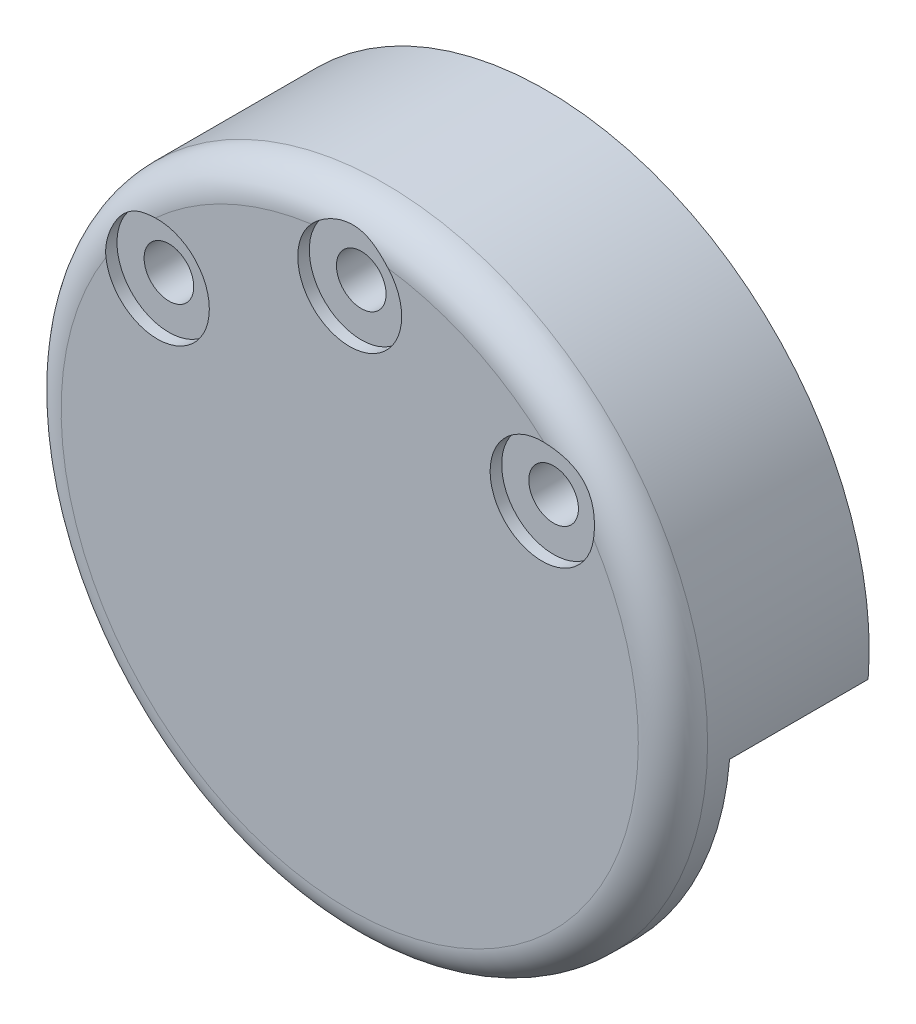
ISO-10303-21;
HEADER;
FILE_DESCRIPTION(('STEP AP214'),'2;1');
FILE_NAME('part.step','',(''),(''),'','','');
FILE_SCHEMA(('AUTOMOTIVE_DESIGN { 1 0 10303 214 1 1 1 1 }'));
ENDSEC;
DATA;
#1=APPLICATION_CONTEXT('core data for automotive mechanical design processes');
#2=APPLICATION_PROTOCOL_DEFINITION('international standard','automotive_design',2000,#1);
#3=PRODUCT_CONTEXT('',#1,'mechanical');
#4=PRODUCT('Part','Part','',(#3));
#5=PRODUCT_RELATED_PRODUCT_CATEGORY('part','',(#4));
#6=PRODUCT_DEFINITION_FORMATION('','',#4);
#7=PRODUCT_DEFINITION_CONTEXT('part definition',#1,'design');
#8=PRODUCT_DEFINITION('design','',#6,#7);
#9=PRODUCT_DEFINITION_SHAPE('','',#8);
#10=(LENGTH_UNIT() NAMED_UNIT(*) SI_UNIT(.MILLI.,.METRE.));
#11=(NAMED_UNIT(*) PLANE_ANGLE_UNIT() SI_UNIT($,.RADIAN.));
#12=(NAMED_UNIT(*) SI_UNIT($,.STERADIAN.) SOLID_ANGLE_UNIT());
#13=UNCERTAINTY_MEASURE_WITH_UNIT(LENGTH_MEASURE(1.E-05),#10,'distance_accuracy_value','');
#14=(GEOMETRIC_REPRESENTATION_CONTEXT(3) GLOBAL_UNCERTAINTY_ASSIGNED_CONTEXT((#13)) GLOBAL_UNIT_ASSIGNED_CONTEXT((#10,
#11,#12)) REPRESENTATION_CONTEXT('',''));
#15=CARTESIAN_POINT('',(0.,0.,0.));
#16=DIRECTION('',(0.,0.,1.));
#17=DIRECTION('',(1.,0.,0.));
#18=AXIS2_PLACEMENT_3D('',#15,#16,#17);
#19=CARTESIAN_POINT('',(16.6614666378377,13.9806305106823,18.));
#20=DIRECTION('',(0.,0.,-1.));
#21=DIRECTION('',(-1.,0.,0.));
#22=AXIS2_PLACEMENT_3D('',#19,#20,#21);
#23=CYLINDRICAL_SURFACE('',#22,2.15);
#24=CARTESIAN_POINT('',(16.6614666378377,13.9806305106823,0.));
#25=DIRECTION('',(0.,0.,1.));
#26=DIRECTION('',(-1.,0.,0.));
#27=AXIS2_PLACEMENT_3D('',#24,#25,#26);
#28=CIRCLE('',#27,2.15);
#29=CARTESIAN_POINT('',(14.5114666378377,13.9806305106823,0.));
#30=VERTEX_POINT('',#29);
#31=EDGE_CURVE('E234',#30,#30,#28,.T.);
#32=ORIENTED_EDGE('',*,*,#31,.F.);
#33=EDGE_LOOP('',(#32));
#34=FACE_BOUND('',#33,.T.);
#35=CARTESIAN_POINT('',(16.6614666378377,13.9806305106823,16.));
#36=DIRECTION('',(0.,0.,1.));
#37=DIRECTION('',(1.,0.,0.));
#38=AXIS2_PLACEMENT_3D('',#35,#36,#37);
#39=CIRCLE('',#38,2.15);
#40=CARTESIAN_POINT('',(18.8114666378377,13.9806305106823,16.));
#41=VERTEX_POINT('',#40);
#42=EDGE_CURVE('E230',#41,#41,#39,.T.);
#43=ORIENTED_EDGE('',*,*,#42,.T.);
#44=EDGE_LOOP('',(#43));
#45=FACE_BOUND('',#44,.T.);
#46=ADVANCED_FACE('F39',(#34,#45),#23,.F.);
#47=CARTESIAN_POINT('',(0.,21.75,18.));
#48=DIRECTION('',(0.,0.,-1.));
#49=DIRECTION('',(-1.,0.,0.));
#50=AXIS2_PLACEMENT_3D('',#47,#48,#49);
#51=CYLINDRICAL_SURFACE('',#50,2.15);
#52=CARTESIAN_POINT('',(0.,21.75,0.));
#53=DIRECTION('',(0.,0.,1.));
#54=DIRECTION('',(1.,0.,0.));
#55=AXIS2_PLACEMENT_3D('',#52,#53,#54);
#56=CIRCLE('',#55,2.15);
#57=CARTESIAN_POINT('',(2.15,21.75,0.));
#58=VERTEX_POINT('',#57);
#59=EDGE_CURVE('E414',#58,#58,#56,.T.);
#60=ORIENTED_EDGE('',*,*,#59,.F.);
#61=EDGE_LOOP('',(#60));
#62=FACE_BOUND('',#61,.T.);
#63=CARTESIAN_POINT('',(0.,21.75,16.));
#64=DIRECTION('',(0.,0.,1.));
#65=DIRECTION('',(1.,0.,0.));
#66=AXIS2_PLACEMENT_3D('',#63,#64,#65);
#67=CIRCLE('',#66,2.15);
#68=CARTESIAN_POINT('',(2.15,21.75,16.));
#69=VERTEX_POINT('',#68);
#70=EDGE_CURVE('E225',#69,#69,#67,.T.);
#71=ORIENTED_EDGE('',*,*,#70,.T.);
#72=EDGE_LOOP('',(#71));
#73=FACE_BOUND('',#72,.T.);
#74=ADVANCED_FACE('F274',(#62,#73),#51,.F.);
#75=CARTESIAN_POINT('',(-16.6614666378377,13.9806305106823,18.));
#76=DIRECTION('',(0.,0.,-1.));
#77=DIRECTION('',(-1.,0.,0.));
#78=AXIS2_PLACEMENT_3D('',#75,#76,#77);
#79=CYLINDRICAL_SURFACE('',#78,2.15);
#80=CARTESIAN_POINT('',(-16.6614666378377,13.9806305106823,0.));
#81=DIRECTION('',(0.,0.,1.));
#82=DIRECTION('',(1.,0.,0.));
#83=AXIS2_PLACEMENT_3D('',#80,#81,#82);
#84=CIRCLE('',#83,2.15);
#85=CARTESIAN_POINT('',(-14.5114666378377,13.9806305106823,0.));
#86=VERTEX_POINT('',#85);
#87=EDGE_CURVE('E410',#86,#86,#84,.T.);
#88=ORIENTED_EDGE('',*,*,#87,.F.);
#89=EDGE_LOOP('',(#88));
#90=FACE_BOUND('',#89,.T.);
#91=CARTESIAN_POINT('',(-16.6614666378377,13.9806305106823,16.));
#92=DIRECTION('',(0.,0.,1.));
#93=DIRECTION('',(1.,0.,0.));
#94=AXIS2_PLACEMENT_3D('',#91,#92,#93);
#95=CIRCLE('',#94,2.15);
#96=CARTESIAN_POINT('',(-14.5114666378377,13.9806305106823,16.));
#97=VERTEX_POINT('',#96);
#98=EDGE_CURVE('E221',#97,#97,#95,.T.);
#99=ORIENTED_EDGE('',*,*,#98,.T.);
#100=EDGE_LOOP('',(#99));
#101=FACE_BOUND('',#100,.T.);
#102=ADVANCED_FACE('F270',(#90,#101),#79,.F.);
#103=CARTESIAN_POINT('',(0.,0.,-7.00000000000001));
#104=DIRECTION('',(0.,0.,1.));
#105=DIRECTION('',(1.,0.,0.));
#106=AXIS2_PLACEMENT_3D('',#103,#104,#105);
#107=CYLINDRICAL_SURFACE('',#106,14.9965397553897);
#108=CARTESIAN_POINT('',(0.,0.,0.));
#109=DIRECTION('',(0.,0.,1.));
#110=DIRECTION('',(1.,0.,0.));
#111=AXIS2_PLACEMENT_3D('',#108,#109,#110);
#112=CIRCLE('',#111,14.9965397553897);
#113=CARTESIAN_POINT('',(14.9839357955723,0.614713517948348,0.));
#114=VERTEX_POINT('',#113);
#115=CARTESIAN_POINT('',(-13.6740535919933,6.15763452945024,0.));
#116=VERTEX_POINT('',#115);
#117=EDGE_CURVE('E210',#114,#116,#112,.T.);
#118=ORIENTED_EDGE('',*,*,#117,.F.);
#119=DIRECTION('',(0.,0.,1.));
#120=VECTOR('',#119,1.);
#121=CARTESIAN_POINT('',(14.9839357955724,0.614713517948348,-7.00000000000001));
#122=LINE('',#121,#120);
#123=CARTESIAN_POINT('',(14.9839357955723,0.614713517948348,12.));
#124=VERTEX_POINT('',#123);
#125=EDGE_CURVE('E345',#114,#124,#122,.T.);
#126=ORIENTED_EDGE('',*,*,#125,.T.);
#127=CARTESIAN_POINT('',(0.,0.,12.));
#128=DIRECTION('',(0.,0.,1.));
#129=DIRECTION('',(1.,0.,0.));
#130=AXIS2_PLACEMENT_3D('',#127,#128,#129);
#131=CIRCLE('',#130,14.9965397553897);
#132=CARTESIAN_POINT('',(-13.6740535919933,6.15763452945024,12.));
#133=VERTEX_POINT('',#132);
#134=EDGE_CURVE('E185',#133,#124,#131,.F.);
#135=ORIENTED_EDGE('',*,*,#134,.F.);
#136=DIRECTION('',(0.,0.,1.));
#137=VECTOR('',#136,1.);
#138=CARTESIAN_POINT('',(-13.6740535919933,6.15763452945024,-7.00000000000001));
#139=LINE('',#138,#137);
#140=EDGE_CURVE('E191',#116,#133,#139,.T.);
#141=ORIENTED_EDGE('',*,*,#140,.F.);
#142=EDGE_LOOP('',(#118,#126,#135,#141));
#143=FACE_BOUND('',#142,.T.);
#144=ADVANCED_FACE('F273',(#143),#107,.F.);
#145=CARTESIAN_POINT('',(14.9965397519868,-2.26231541112962,-7.00000000000001));
#146=DIRECTION('',(0.,1.,0.));
#147=DIRECTION('',(0.,0.,1.));
#148=AXIS2_PLACEMENT_3D('',#145,#146,#147);
#149=PLANE('',#148);
#150=DIRECTION('',(1.,0.,0.));
#151=VECTOR('',#150,1.);
#152=CARTESIAN_POINT('',(14.9965397519868,-2.26231541112962,12.));
#153=LINE('',#152,#151);
#154=CARTESIAN_POINT('',(17.9814144219709,-2.26231541112962,12.));
#155=VERTEX_POINT('',#154);
#156=CARTESIAN_POINT('',(27.9084562271109,-2.26231541112964,12.));
#157=VERTEX_POINT('',#156);
#158=EDGE_CURVE('E188',#155,#157,#153,.T.);
#159=ORIENTED_EDGE('',*,*,#158,.F.);
#160=DIRECTION('',(0.,0.,1.));
#161=VECTOR('',#160,1.);
#162=CARTESIAN_POINT('',(17.9814144219709,-2.26231541112962,-7.00000000000001));
#163=LINE('',#162,#161);
#164=CARTESIAN_POINT('',(17.9814144219709,-2.26231541112962,0.));
#165=VERTEX_POINT('',#164);
#166=EDGE_CURVE('E55',#155,#165,#163,.F.);
#167=ORIENTED_EDGE('',*,*,#166,.T.);
#168=DIRECTION('',(-1.,0.,0.));
#169=VECTOR('',#168,1.);
#170=CARTESIAN_POINT('',(0.,-2.26231541112962,0.));
#171=LINE('',#170,#169);
#172=CARTESIAN_POINT('',(27.9084562271109,-2.26231541112964,0.));
#173=VERTEX_POINT('',#172);
#174=EDGE_CURVE('E213',#173,#165,#171,.T.);
#175=ORIENTED_EDGE('',*,*,#174,.F.);
#176=DIRECTION('',(0.,0.,1.));
#177=VECTOR('',#176,1.);
#178=CARTESIAN_POINT('',(27.9084562271109,-2.26231541112964,-7.00000000000001));
#179=LINE('',#178,#177);
#180=EDGE_CURVE('E192',#173,#157,#179,.T.);
#181=ORIENTED_EDGE('',*,*,#180,.T.);
#182=EDGE_LOOP('',(#159,#167,#175,#181));
#183=FACE_BOUND('',#182,.T.);
#184=ADVANCED_FACE('F310',(#183),#149,.F.);
#185=CARTESIAN_POINT('',(-13.6740535919933,6.15763452945024,-7.00000000000001));
#186=DIRECTION('',(0.,1.,0.));
#187=DIRECTION('',(0.,0.,1.));
#188=AXIS2_PLACEMENT_3D('',#185,#186,#187);
#189=PLANE('',#188);
#190=DIRECTION('',(1.,0.,0.));
#191=VECTOR('',#190,1.);
#192=CARTESIAN_POINT('',(-13.6740535919933,6.15763452945024,12.));
#193=LINE('',#192,#191);
#194=CARTESIAN_POINT('',(-27.3145297781551,6.15763452945024,12.));
#195=VERTEX_POINT('',#194);
#196=EDGE_CURVE('E216',#195,#133,#193,.T.);
#197=ORIENTED_EDGE('',*,*,#196,.F.);
#198=DIRECTION('',(0.,0.,1.));
#199=VECTOR('',#198,1.);
#200=CARTESIAN_POINT('',(-27.3145297781551,6.15763452945024,-7.00000000000001));
#201=LINE('',#200,#199);
#202=CARTESIAN_POINT('',(-27.3145297781551,6.15763452945024,0.));
#203=VERTEX_POINT('',#202);
#204=EDGE_CURVE('E197',#203,#195,#201,.T.);
#205=ORIENTED_EDGE('',*,*,#204,.F.);
#206=DIRECTION('',(-1.,0.,0.));
#207=VECTOR('',#206,1.);
#208=CARTESIAN_POINT('',(0.,6.15763452945024,0.));
#209=LINE('',#208,#207);
#210=EDGE_CURVE('E206',#116,#203,#209,.T.);
#211=ORIENTED_EDGE('',*,*,#210,.F.);
#212=ORIENTED_EDGE('',*,*,#140,.T.);
#213=EDGE_LOOP('',(#197,#205,#211,#212));
#214=FACE_BOUND('',#213,.T.);
#215=ADVANCED_FACE('F313',(#214),#189,.F.);
#216=CARTESIAN_POINT('',(0.,0.,15.));
#217=DIRECTION('',(0.,0.,-1.));
#218=DIRECTION('',(-1.,0.,0.));
#219=AXIS2_PLACEMENT_3D('',#216,#217,#218);
#220=CYLINDRICAL_SURFACE('',#219,28.);
#221=CARTESIAN_POINT('',(0.,0.,14.));
#222=DIRECTION('',(0.,0.,1.));
#223=DIRECTION('',(1.,0.,0.));
#224=AXIS2_PLACEMENT_3D('',#221,#222,#223);
#225=CIRCLE('',#224,28.);
#226=CARTESIAN_POINT('',(28.,0.,14.));
#227=VERTEX_POINT('',#226);
#228=EDGE_CURVE('E330',#227,#227,#225,.F.);
#229=ORIENTED_EDGE('',*,*,#228,.T.);
#230=EDGE_LOOP('',(#229));
#231=FACE_BOUND('',#230,.T.);
#232=CARTESIAN_POINT('',(1.62370117351429E-12,2.99760216648792E-12,12.));
#233=DIRECTION('',(0.,0.,1.));
#234=DIRECTION('',(1.,0.,0.));
#235=AXIS2_PLACEMENT_3D('',#232,#233,#234);
#236=CIRCLE('',#235,28.0000000000101);
#237=CARTESIAN_POINT('',(-27.7758888246601,3.53553390593871,12.));
#238=VERTEX_POINT('',#237);
#239=EDGE_CURVE('E181',#195,#238,#236,.T.);
#240=ORIENTED_EDGE('',*,*,#239,.T.);
#241=DIRECTION('',(0.,0.,-1.));
#242=VECTOR('',#241,1.);
#243=CARTESIAN_POINT('',(-27.7758888246601,3.53553390593871,13.));
#244=LINE('',#243,#242);
#245=CARTESIAN_POINT('',(-27.7758888246601,3.53553390593871,13.));
#246=VERTEX_POINT('',#245);
#247=EDGE_CURVE('E176',#246,#238,#244,.T.);
#248=ORIENTED_EDGE('',*,*,#247,.F.);
#249=CARTESIAN_POINT('',(0.,0.,13.));
#250=DIRECTION('',(0.,0.,-1.));
#251=DIRECTION('',(-1.,0.,0.));
#252=AXIS2_PLACEMENT_3D('',#249,#250,#251);
#253=CIRCLE('',#252,27.9999999999982);
#254=CARTESIAN_POINT('',(-27.7758888246626,-3.53553390591575,13.));
#255=VERTEX_POINT('',#254);
#256=EDGE_CURVE('E148',#255,#246,#253,.T.);
#257=ORIENTED_EDGE('',*,*,#256,.F.);
#258=DIRECTION('',(0.,0.,-1.));
#259=VECTOR('',#258,1.);
#260=CARTESIAN_POINT('',(-27.7758888246626,-3.53553390591575,13.));
#261=LINE('',#260,#259);
#262=CARTESIAN_POINT('',(-27.7758888246626,-3.53553390591575,12.));
#263=VERTEX_POINT('',#262);
#264=EDGE_CURVE('E138',#255,#263,#261,.T.);
#265=ORIENTED_EDGE('',*,*,#264,.T.);
#266=EDGE_CURVE('E175',#263,#157,#236,.T.);
#267=ORIENTED_EDGE('',*,*,#266,.T.);
#268=ORIENTED_EDGE('',*,*,#180,.F.);
#269=CARTESIAN_POINT('',(0.,0.,0.));
#270=DIRECTION('',(0.,0.,1.));
#271=DIRECTION('',(1.,0.,0.));
#272=AXIS2_PLACEMENT_3D('',#269,#270,#271);
#273=CIRCLE('',#272,28.);
#274=EDGE_CURVE('E196',#173,#203,#273,.T.);
#275=ORIENTED_EDGE('',*,*,#274,.T.);
#276=ORIENTED_EDGE('',*,*,#204,.T.);
#277=EDGE_LOOP('',(#240,#248,#257,#265,#267,#268,#275,#276));
#278=FACE_BOUND('',#277,.T.);
#279=ADVANCED_FACE('F316',(#231,#278),#220,.T.);
#280=CARTESIAN_POINT('',(0.,0.,0.));
#281=DIRECTION('',(0.,0.,1.));
#282=DIRECTION('',(1.,0.,0.));
#283=AXIS2_PLACEMENT_3D('',#280,#281,#282);
#284=PLANE('',#283);
#285=ORIENTED_EDGE('',*,*,#87,.T.);
#286=EDGE_LOOP('',(#285));
#287=FACE_BOUND('',#286,.T.);
#288=ORIENTED_EDGE('',*,*,#59,.T.);
#289=EDGE_LOOP('',(#288));
#290=FACE_BOUND('',#289,.T.);
#291=ORIENTED_EDGE('',*,*,#31,.T.);
#292=EDGE_LOOP('',(#291));
#293=FACE_BOUND('',#292,.T.);
#294=ORIENTED_EDGE('',*,*,#174,.T.);
#295=CARTESIAN_POINT('',(17.9814144219709,0.737684588870377,0.));
#296=DIRECTION('',(0.,0.,1.));
#297=DIRECTION('',(1.,0.,0.));
#298=AXIS2_PLACEMENT_3D('',#295,#296,#297);
#299=CIRCLE('',#298,3.);
#300=EDGE_CURVE('E48',#165,#114,#299,.F.);
#301=ORIENTED_EDGE('',*,*,#300,.T.);
#302=ORIENTED_EDGE('',*,*,#117,.T.);
#303=ORIENTED_EDGE('',*,*,#210,.T.);
#304=ORIENTED_EDGE('',*,*,#274,.F.);
#305=EDGE_LOOP('',(#294,#301,#302,#303,#304));
#306=FACE_BOUND('',#305,.T.);
#307=ADVANCED_FACE('F306',(#287,#290,#293,#306),#284,.F.);
#308=CARTESIAN_POINT('',(1.62370117351429E-12,2.99760216648792E-12,12.));
#309=DIRECTION('',(0.,0.,1.));
#310=DIRECTION('',(1.,0.,0.));
#311=AXIS2_PLACEMENT_3D('',#308,#309,#310);
#312=PLANE('',#311);
#313=CARTESIAN_POINT('',(-23.0000000000057,1.12312503047773E-11,12.));
#314=DIRECTION('',(0.,0.,-1.));
#315=DIRECTION('',(-1.,0.,0.));
#316=AXIS2_PLACEMENT_3D('',#313,#314,#315);
#317=CIRCLE('',#316,4.99999999999241);
#318=CARTESIAN_POINT('',(-26.535533905933,3.53553390593871,12.));
#319=VERTEX_POINT('',#318);
#320=CARTESIAN_POINT('',(-26.5355339059336,-3.53553390591569,12.));
#321=VERTEX_POINT('',#320);
#322=EDGE_CURVE('E134',#319,#321,#317,.T.);
#323=ORIENTED_EDGE('',*,*,#322,.F.);
#324=DIRECTION('',(1.,0.,0.));
#325=VECTOR('',#324,1.);
#326=CARTESIAN_POINT('',(-26.535533905933,3.53553390593871,12.));
#327=LINE('',#326,#325);
#328=EDGE_CURVE('E153',#238,#319,#327,.T.);
#329=ORIENTED_EDGE('',*,*,#328,.F.);
#330=ORIENTED_EDGE('',*,*,#239,.F.);
#331=ORIENTED_EDGE('',*,*,#196,.T.);
#332=ORIENTED_EDGE('',*,*,#134,.T.);
#333=CARTESIAN_POINT('',(17.9814144219709,0.737684588870377,12.));
#334=DIRECTION('',(0.,0.,1.));
#335=DIRECTION('',(1.,0.,0.));
#336=AXIS2_PLACEMENT_3D('',#333,#334,#335);
#337=CIRCLE('',#336,3.);
#338=EDGE_CURVE('E11',#124,#155,#337,.T.);
#339=ORIENTED_EDGE('',*,*,#338,.T.);
#340=ORIENTED_EDGE('',*,*,#158,.T.);
#341=ORIENTED_EDGE('',*,*,#266,.F.);
#342=DIRECTION('',(-1.,0.,0.));
#343=VECTOR('',#342,1.);
#344=CARTESIAN_POINT('',(-26.5355339059336,-3.53553390591569,12.));
#345=LINE('',#344,#343);
#346=EDGE_CURVE('E157',#321,#263,#345,.T.);
#347=ORIENTED_EDGE('',*,*,#346,.F.);
#348=EDGE_LOOP('',(#323,#329,#330,#331,#332,#339,#340,#341,#347));
#349=FACE_BOUND('',#348,.T.);
#350=ADVANCED_FACE('F303',(#349),#312,.F.);
#351=CARTESIAN_POINT('',(1.62370117351429E-12,2.99760216648792E-12,17.));
#352=DIRECTION('',(0.,0.,1.));
#353=DIRECTION('',(1.,0.,0.));
#354=AXIS2_PLACEMENT_3D('',#351,#352,#353);
#355=PLANE('',#354);
#356=CARTESIAN_POINT('',(16.6614666378377,13.9806305106823,17.));
#357=DIRECTION('',(0.,0.,1.));
#358=DIRECTION('',(1.,0.,0.));
#359=AXIS2_PLACEMENT_3D('',#356,#357,#358);
#360=CIRCLE('',#359,4.5);
#361=CARTESIAN_POINT('',(16.8403612347571,18.4770731849741,17.));
#362=VERTEX_POINT('',#361);
#363=CARTESIAN_POINT('',(21.1206629652048,13.3760082203258,17.));
#364=VERTEX_POINT('',#363);
#365=EDGE_CURVE('E392',#362,#364,#360,.T.);
#366=ORIENTED_EDGE('',*,*,#365,.F.);
#367=CARTESIAN_POINT('',(0.,0.,17.));
#368=DIRECTION('',(0.,0.,1.));
#369=DIRECTION('',(1.,0.,0.));
#370=AXIS2_PLACEMENT_3D('',#367,#368,#369);
#371=CIRCLE('',#370,25.);
#372=CARTESIAN_POINT('',(3.32948369410469,24.7772988505747,17.));
#373=VERTEX_POINT('',#372);
#374=EDGE_CURVE('E240',#362,#373,#371,.T.);
#375=ORIENTED_EDGE('',*,*,#374,.T.);
#376=CARTESIAN_POINT('',(0.,21.75,17.));
#377=DIRECTION('',(0.,0.,1.));
#378=DIRECTION('',(1.,0.,0.));
#379=AXIS2_PLACEMENT_3D('',#376,#377,#378);
#380=CIRCLE('',#379,4.5);
#381=CARTESIAN_POINT('',(-3.32948369410469,24.7772988505747,17.));
#382=VERTEX_POINT('',#381);
#383=EDGE_CURVE('E400',#382,#373,#380,.T.);
#384=ORIENTED_EDGE('',*,*,#383,.F.);
#385=CARTESIAN_POINT('',(0.,0.,17.));
#386=DIRECTION('',(0.,0.,1.));
#387=DIRECTION('',(1.,0.,0.));
#388=AXIS2_PLACEMENT_3D('',#385,#386,#387);
#389=CIRCLE('',#388,25.);
#390=CARTESIAN_POINT('',(-16.8403612347571,18.4770731849741,17.));
#391=VERTEX_POINT('',#390);
#392=EDGE_CURVE('E237',#382,#391,#389,.T.);
#393=ORIENTED_EDGE('',*,*,#392,.T.);
#394=CARTESIAN_POINT('',(-16.6614666378377,13.9806305106823,17.));
#395=DIRECTION('',(0.,0.,1.));
#396=DIRECTION('',(1.,0.,0.));
#397=AXIS2_PLACEMENT_3D('',#394,#395,#396);
#398=CIRCLE('',#397,4.5);
#399=CARTESIAN_POINT('',(-21.1206629652048,13.3760082203258,17.));
#400=VERTEX_POINT('',#399);
#401=EDGE_CURVE('E380',#400,#391,#398,.T.);
#402=ORIENTED_EDGE('',*,*,#401,.F.);
#403=CARTESIAN_POINT('',(0.,0.,17.));
#404=DIRECTION('',(0.,0.,1.));
#405=DIRECTION('',(1.,0.,0.));
#406=AXIS2_PLACEMENT_3D('',#403,#404,#405);
#407=CIRCLE('',#406,25.);
#408=EDGE_CURVE('E220',#400,#364,#407,.T.);
#409=ORIENTED_EDGE('',*,*,#408,.T.);
#410=EDGE_LOOP('',(#366,#375,#384,#393,#402,#409));
#411=FACE_BOUND('',#410,.T.);
#412=ADVANCED_FACE('F302',(#411),#355,.T.);
#413=CARTESIAN_POINT('',(-23.0000000000057,1.12312503047773E-11,13.));
#414=DIRECTION('',(0.,0.,-1.));
#415=DIRECTION('',(-1.,0.,0.));
#416=AXIS2_PLACEMENT_3D('',#413,#414,#415);
#417=CYLINDRICAL_SURFACE('',#416,4.99999999999241);
#418=ORIENTED_EDGE('',*,*,#322,.T.);
#419=DIRECTION('',(0.,0.,-1.));
#420=VECTOR('',#419,1.);
#421=CARTESIAN_POINT('',(-26.5355339059336,-3.53553390591569,13.));
#422=LINE('',#421,#420);
#423=CARTESIAN_POINT('',(-26.5355339059336,-3.53553390591569,13.));
#424=VERTEX_POINT('',#423);
#425=EDGE_CURVE('E127',#424,#321,#422,.T.);
#426=ORIENTED_EDGE('',*,*,#425,.F.);
#427=CARTESIAN_POINT('',(-23.0000000000057,1.12312503047773E-11,13.));
#428=DIRECTION('',(0.,0.,-1.));
#429=DIRECTION('',(-1.,0.,0.));
#430=AXIS2_PLACEMENT_3D('',#427,#428,#429);
#431=CIRCLE('',#430,4.99999999999241);
#432=CARTESIAN_POINT('',(-26.535533905933,3.53553390593871,13.));
#433=VERTEX_POINT('',#432);
#434=EDGE_CURVE('E131',#433,#424,#431,.T.);
#435=ORIENTED_EDGE('',*,*,#434,.F.);
#436=DIRECTION('',(0.,0.,-1.));
#437=VECTOR('',#436,1.);
#438=CARTESIAN_POINT('',(-26.535533905933,3.53553390593871,13.));
#439=LINE('',#438,#437);
#440=EDGE_CURVE('E172',#433,#319,#439,.T.);
#441=ORIENTED_EDGE('',*,*,#440,.T.);
#442=EDGE_LOOP('',(#418,#426,#435,#441));
#443=FACE_BOUND('',#442,.T.);
#444=ADVANCED_FACE('F129',(#443),#417,.F.);
#445=CARTESIAN_POINT('',(-26.535533905933,3.53553390593871,13.));
#446=DIRECTION('',(0.,1.,0.));
#447=DIRECTION('',(-1.,0.,0.));
#448=AXIS2_PLACEMENT_3D('',#445,#446,#447);
#449=PLANE('',#448);
#450=ORIENTED_EDGE('',*,*,#328,.T.);
#451=ORIENTED_EDGE('',*,*,#440,.F.);
#452=DIRECTION('',(1.,0.,0.));
#453=VECTOR('',#452,1.);
#454=CARTESIAN_POINT('',(-26.535533905933,3.53553390593871,13.));
#455=LINE('',#454,#453);
#456=EDGE_CURVE('E139',#246,#433,#455,.T.);
#457=ORIENTED_EDGE('',*,*,#456,.F.);
#458=ORIENTED_EDGE('',*,*,#247,.T.);
#459=EDGE_LOOP('',(#450,#451,#457,#458));
#460=FACE_BOUND('',#459,.T.);
#461=ADVANCED_FACE('F294',(#460),#449,.F.);
#462=CARTESIAN_POINT('',(-26.5355339059336,-3.53553390591569,13.));
#463=DIRECTION('',(0.,-1.,0.));
#464=DIRECTION('',(0.,0.,-1.));
#465=AXIS2_PLACEMENT_3D('',#462,#463,#464);
#466=PLANE('',#465);
#467=ORIENTED_EDGE('',*,*,#346,.T.);
#468=ORIENTED_EDGE('',*,*,#264,.F.);
#469=DIRECTION('',(-1.,0.,0.));
#470=VECTOR('',#469,1.);
#471=CARTESIAN_POINT('',(-26.5355339059336,-3.53553390591569,13.));
#472=LINE('',#471,#470);
#473=EDGE_CURVE('E142',#424,#255,#472,.T.);
#474=ORIENTED_EDGE('',*,*,#473,.F.);
#475=ORIENTED_EDGE('',*,*,#425,.T.);
#476=EDGE_LOOP('',(#467,#468,#474,#475));
#477=FACE_BOUND('',#476,.T.);
#478=ADVANCED_FACE('F143',(#477),#466,.F.);
#479=CARTESIAN_POINT('',(-23.0000000000057,1.12312503047773E-11,13.));
#480=DIRECTION('',(0.,0.,-1.));
#481=DIRECTION('',(-1.,0.,0.));
#482=AXIS2_PLACEMENT_3D('',#479,#480,#481);
#483=PLANE('',#482);
#484=CARTESIAN_POINT('',(-23.0000000000107,-1.94462501657E-12,13.));
#485=DIRECTION('',(0.,0.,-1.));
#486=DIRECTION('',(-1.,0.,0.));
#487=AXIS2_PLACEMENT_3D('',#484,#485,#486);
#488=CIRCLE('',#487,4.50000000000512);
#489=CARTESIAN_POINT('',(-27.5000000000158,-1.94462501657E-12,13.));
#490=VERTEX_POINT('',#489);
#491=EDGE_CURVE('E160',#490,#490,#488,.T.);
#492=ORIENTED_EDGE('',*,*,#491,.F.);
#493=EDGE_LOOP('',(#492));
#494=FACE_BOUND('',#493,.T.);
#495=ORIENTED_EDGE('',*,*,#434,.T.);
#496=ORIENTED_EDGE('',*,*,#473,.T.);
#497=ORIENTED_EDGE('',*,*,#256,.T.);
#498=ORIENTED_EDGE('',*,*,#456,.T.);
#499=EDGE_LOOP('',(#495,#496,#497,#498));
#500=FACE_BOUND('',#499,.T.);
#501=ADVANCED_FACE('F150',(#494,#500),#483,.T.);
#502=CARTESIAN_POINT('',(-23.0000000000107,-1.94462501657E-12,14.));
#503=DIRECTION('',(0.,0.,-1.));
#504=DIRECTION('',(-1.,0.,0.));
#505=AXIS2_PLACEMENT_3D('',#502,#503,#504);
#506=CYLINDRICAL_SURFACE('',#505,4.50000000000512);
#507=CARTESIAN_POINT('',(-23.0000000000107,-1.94462501657E-12,14.));
#508=DIRECTION('',(0.,0.,-1.));
#509=DIRECTION('',(-1.,0.,0.));
#510=AXIS2_PLACEMENT_3D('',#507,#508,#509);
#511=CIRCLE('',#510,4.50000000000512);
#512=CARTESIAN_POINT('',(-27.5000000000158,-1.94462501657E-12,14.));
#513=VERTEX_POINT('',#512);
#514=EDGE_CURVE('E169',#513,#513,#511,.T.);
#515=ORIENTED_EDGE('',*,*,#514,.F.);
#516=EDGE_LOOP('',(#515));
#517=FACE_BOUND('',#516,.T.);
#518=ORIENTED_EDGE('',*,*,#491,.T.);
#519=EDGE_LOOP('',(#518));
#520=FACE_BOUND('',#519,.T.);
#521=ADVANCED_FACE('F286',(#517,#520),#506,.F.);
#522=CARTESIAN_POINT('',(-23.0000000000107,-1.94462501657E-12,14.));
#523=DIRECTION('',(0.,0.,-1.));
#524=DIRECTION('',(-1.,0.,0.));
#525=AXIS2_PLACEMENT_3D('',#522,#523,#524);
#526=PLANE('',#525);
#527=ORIENTED_EDGE('',*,*,#514,.T.);
#528=EDGE_LOOP('',(#527));
#529=FACE_BOUND('',#528,.T.);
#530=ADVANCED_FACE('F282',(#529),#526,.T.);
#531=CARTESIAN_POINT('',(-16.6614666378377,13.9806305106823,16.));
#532=DIRECTION('',(0.,0.,1.));
#533=DIRECTION('',(1.,0.,0.));
#534=AXIS2_PLACEMENT_3D('',#531,#532,#533);
#535=CYLINDRICAL_SURFACE('',#534,4.5);
#536=CARTESIAN_POINT('',(-16.6614666378377,13.9806305106823,16.));
#537=DIRECTION('',(0.,0.,1.));
#538=DIRECTION('',(1.,0.,0.));
#539=AXIS2_PLACEMENT_3D('',#536,#537,#538);
#540=CIRCLE('',#539,4.5);
#541=CARTESIAN_POINT('',(-12.1614666378377,13.9806305106823,16.));
#542=VERTEX_POINT('',#541);
#543=EDGE_CURVE('E377',#542,#542,#540,.T.);
#544=ORIENTED_EDGE('',*,*,#543,.F.);
#545=EDGE_LOOP('',(#544));
#546=FACE_BOUND('',#545,.T.);
#547=ORIENTED_EDGE('',*,*,#401,.T.);
#548=CARTESIAN_POINT('',(-16.8403612347571,18.4770731849741,17.));
#549=CARTESIAN_POINT('',(-16.9683091700003,18.4720000248007,16.9999790013164));
#550=CARTESIAN_POINT('',(-17.0959517347696,18.4614351403733,16.9966040176478));
#551=CARTESIAN_POINT('',(-17.3495391127848,18.429543938642,16.9847913629736));
#552=CARTESIAN_POINT('',(-17.4754853971391,18.4082276577885,16.9763584122042));
#553=CARTESIAN_POINT('',(-17.7246742901872,18.3550797737083,16.9560820521996));
#554=CARTESIAN_POINT('',(-17.8479201794831,18.3232617815978,16.9442430600212));
#555=CARTESIAN_POINT('',(-18.091075386554,18.2493997125547,16.9186271620935));
#556=CARTESIAN_POINT('',(-18.2109840562423,18.2073536645684,16.9048498830321));
#557=CARTESIAN_POINT('',(-18.5507608944905,18.0717776992356,16.8643695844316));
#558=CARTESIAN_POINT('',(-18.7656878001695,17.9655122404952,16.8369659665528));
#559=CARTESIAN_POINT('',(-19.073507271774,17.7814751059346,16.800548101868));
#560=CARTESIAN_POINT('',(-19.1737173991231,17.7159960046578,16.7891869580684));
#561=CARTESIAN_POINT('',(-19.3687508913006,17.5771443292432,16.7688283658839));
#562=CARTESIAN_POINT('',(-19.463576640773,17.5037752917437,16.7598298646262));
#563=CARTESIAN_POINT('',(-19.6519364780252,17.3455955910891,16.7444850620033));
#564=CARTESIAN_POINT('',(-19.7451523272146,17.2603902012614,16.7382992852412));
#565=CARTESIAN_POINT('',(-19.9241834511137,17.0823420669411,16.7297999464655));
#566=CARTESIAN_POINT('',(-20.0099985825057,16.9894991746134,16.7274864594243));
#567=CARTESIAN_POINT('',(-20.1735100751834,16.79692325463,16.7269276161731));
#568=CARTESIAN_POINT('',(-20.2512071875288,16.6971908657947,16.7286818832755));
#569=CARTESIAN_POINT('',(-20.3978727309643,16.4916485019766,16.736109148743));
#570=CARTESIAN_POINT('',(-20.4668413756193,16.3858386757862,16.7417820512065));
#571=CARTESIAN_POINT('',(-20.5918065993012,16.175288916184,16.756143987472));
#572=CARTESIAN_POINT('',(-20.6483243938566,16.070844787912,16.7646383749733));
#573=CARTESIAN_POINT('',(-20.7528705392581,15.8579959258558,16.7840561075189));
#574=CARTESIAN_POINT('',(-20.8008952315682,15.7495895093995,16.7949804947708));
#575=CARTESIAN_POINT('',(-20.9318378824342,15.4193444999527,16.8302646914649));
#576=CARTESIAN_POINT('',(-21.0016852382242,15.1923773558098,16.8571438991342));
#577=CARTESIAN_POINT('',(-21.0821399524084,14.8322539223067,16.8982043924808));
#578=CARTESIAN_POINT('',(-21.1052906467008,14.7017528642833,16.9127698627029));
#579=CARTESIAN_POINT('',(-21.1400198701921,14.4389929486508,16.9399943284584));
#580=CARTESIAN_POINT('',(-21.1516001976561,14.3067343674345,16.95265361999));
#581=CARTESIAN_POINT('',(-21.1630228547823,14.0411983086652,16.9744202576443));
#582=CARTESIAN_POINT('',(-21.1628471054736,13.9079195769759,16.9835221113761));
#583=CARTESIAN_POINT('',(-21.1506595615345,13.6415281316157,16.9963021172467));
#584=CARTESIAN_POINT('',(-21.1386363564222,13.5084157018665,16.9999750321581));
#585=CARTESIAN_POINT('',(-21.1206629652048,13.3760082203259,17.));
#586=B_SPLINE_CURVE_WITH_KNOTS('',3,(#548,#549,#550,#551,#552,#553,#554,#555,#556,#557,#558,
#559,#560,#561,#562,#563,#564,#565,#566,#567,#568,#569,#570,#571,#572,#573,#574,#575,#576,#577,
#578,#579,#580,#581,#582,#583,#584,#585),.UNSPECIFIED.,.F.,.F.,(4,2,2,2,2,2,2,2,2,2,2,2,2,2,2,2,
2,2,4),(0.,0.383858631837747,0.767359592235775,1.15036544173205,1.53344515902646,
2.25380168684214,2.61422921639258,2.97449585364995,3.3533232719604,3.7321580247581,
4.11095769757861,4.48974810027725,4.84650403205155,5.20341326964208,5.91687650027008,
6.31647540886082,6.71601220217102,7.11616343344479,7.51670043408841),.UNSPECIFIED.);
#587=EDGE_CURVE('E252',#391,#400,#586,.T.);
#588=ORIENTED_EDGE('',*,*,#587,.T.);
#589=EDGE_LOOP('',(#547,#588));
#590=FACE_BOUND('',#589,.T.);
#591=ADVANCED_FACE('F285',(#546,#590),#535,.F.);
#592=CARTESIAN_POINT('',(-16.6614666378377,13.9806305106823,16.));
#593=DIRECTION('',(0.,0.,1.));
#594=DIRECTION('',(1.,0.,0.));
#595=AXIS2_PLACEMENT_3D('',#592,#593,#594);
#596=PLANE('',#595);
#597=ORIENTED_EDGE('',*,*,#98,.F.);
#598=EDGE_LOOP('',(#597));
#599=FACE_BOUND('',#598,.T.);
#600=ORIENTED_EDGE('',*,*,#543,.T.);
#601=EDGE_LOOP('',(#600));
#602=FACE_BOUND('',#601,.T.);
#603=ADVANCED_FACE('F268',(#599,#602),#596,.T.);
#604=CARTESIAN_POINT('',(0.,21.75,16.));
#605=DIRECTION('',(0.,0.,1.));
#606=DIRECTION('',(1.,0.,0.));
#607=AXIS2_PLACEMENT_3D('',#604,#605,#606);
#608=CYLINDRICAL_SURFACE('',#607,4.5);
#609=CARTESIAN_POINT('',(0.,21.75,16.));
#610=DIRECTION('',(0.,0.,1.));
#611=DIRECTION('',(1.,0.,0.));
#612=AXIS2_PLACEMENT_3D('',#609,#610,#611);
#613=CIRCLE('',#612,4.5);
#614=CARTESIAN_POINT('',(4.5,21.75,16.));
#615=VERTEX_POINT('',#614);
#616=EDGE_CURVE('E226',#615,#615,#613,.T.);
#617=ORIENTED_EDGE('',*,*,#616,.F.);
#618=EDGE_LOOP('',(#617));
#619=FACE_BOUND('',#618,.T.);
#620=ORIENTED_EDGE('',*,*,#383,.T.);
#621=CARTESIAN_POINT('',(3.32948369410469,24.7772988505747,17.));
#622=CARTESIAN_POINT('',(3.24335408048551,24.8720516908748,16.9999790013164));
#623=CARTESIAN_POINT('',(3.15321385037536,24.9630405915141,16.9966040176479));
#624=CARTESIAN_POINT('',(2.96578094794363,25.1368005239569,16.9847913629736));
#625=CARTESIAN_POINT('',(2.86849501837887,25.2195791340008,16.9763584122042));
#626=CARTESIAN_POINT('',(2.6676058441929,25.3763060994394,16.9560820521996));
#627=CARTESIAN_POINT('',(2.56401091756122,25.4502657169781,16.9442430600212));
#628=CARTESIAN_POINT('',(2.3511321356775,25.5890557893635,16.9186271620935));
#629=CARTESIAN_POINT('',(2.24184718709288,25.6538844807781,16.9048498830321));
#630=CARTESIAN_POINT('',(1.91958563054477,25.8270220889314,16.8643695844316));
#631=CARTESIAN_POINT('',(1.70002921442245,25.9233595304876,16.8369659665528));
#632=CARTESIAN_POINT('',(1.3611860477972,26.0408661363763,16.800548101868));
#633=CARTESIAN_POINT('',(1.2466123178985,26.0755423925822,16.7891869580684));
#634=CARTESIAN_POINT('',(1.01488065128384,26.1356945789461,16.7688283658839));
#635=CARTESIAN_POINT('',(0.897723890970195,26.1611746091548,16.7598298646262));
#636=CARTESIAN_POINT('',(0.655475840721286,26.2037906641038,16.7444850620033));
#637=CARTESIAN_POINT('',(0.530286732434631,26.2204291785263,16.7382992852412));
#638=CARTESIAN_POINT('',(0.278814960340272,26.2431278414656,16.7297999464655));
#639=CARTESIAN_POINT('',(0.152532275407138,26.2491877851683,16.7274864594243));
#640=CARTESIAN_POINT('',(-0.100092599509244,26.2506594402308,16.7269276161731));
#641=CARTESIAN_POINT('',(-0.226434782899508,26.2460721375617,16.7286818832754));
#642=CARTESIAN_POINT('',(-0.47816416261625,26.2263043773795,16.736109148743));
#643=CARTESIAN_POINT('',(-0.603551382237849,26.2111241791086,16.7417820512065));
#644=CARTESIAN_POINT('',(-0.845167953005655,26.1715143175985,16.7561439874719));
#645=CARTESIAN_POINT('',(-0.961505735151818,26.1476740684972,16.7646383749733));
#646=CARTESIAN_POINT('',(-1.19175839005877,26.0909444509659,16.7840561075189));
#647=CARTESIAN_POINT('',(-1.30567220015943,26.058051198334,16.7949804947708));
#648=CARTESIAN_POINT('',(-1.64282286807015,25.946081688164,16.8302646914649));
#649=CARTESIAN_POINT('',(-1.86158680248255,25.8536961988724,16.8571438991342));
#650=CARTESIAN_POINT('',(-2.18917265097297,25.6838452045824,16.8982043924808));
#651=CARTESIAN_POINT('',(-2.30402324073977,25.617695202151,16.9127698627029));
#652=CARTESIAN_POINT('',(-2.52763252853872,25.4754005127295,16.9399943284584));
#653=CARTESIAN_POINT('',(-2.6363921707442,25.3992573809522,16.95265361999));
#654=CARTESIAN_POINT('',(-2.84714693548255,25.2373243554675,16.9744202576443));
#655=CARTESIAN_POINT('',(-2.94913139780107,25.1515198063216,16.9835221113761));
#656=CARTESIAN_POINT('',(-3.14536508197713,24.9709504856077,16.9963021172467));
#657=CARTESIAN_POINT('',(-3.23960675182164,24.8761771556049,16.9999750321581));
#658=CARTESIAN_POINT('',(-3.32948369410469,24.7772988505747,17.));
#659=B_SPLINE_CURVE_WITH_KNOTS('',3,(#621,#622,#623,#624,#625,#626,#627,#628,#629,#630,#631,
#632,#633,#634,#635,#636,#637,#638,#639,#640,#641,#642,#643,#644,#645,#646,#647,#648,#649,#650,
#651,#652,#653,#654,#655,#656,#657,#658),.UNSPECIFIED.,.F.,.F.,(4,2,2,2,2,2,2,2,2,2,2,2,2,2,2,2,
2,2,4),(0.,0.383858631837745,0.767359592235772,1.15036544173205,1.53344515902646,
2.25380168684214,2.61422921639258,2.97449585364995,3.35332327196039,3.7321580247581,
4.11095769757861,4.48974810027725,4.84650403205155,5.20341326964208,5.91687650027007,
6.31647540886082,6.71601220217103,7.11616343344479,7.51670043408842),.UNSPECIFIED.);
#660=EDGE_CURVE('E244',#373,#382,#659,.T.);
#661=ORIENTED_EDGE('',*,*,#660,.T.);
#662=EDGE_LOOP('',(#620,#661));
#663=FACE_BOUND('',#662,.T.);
#664=ADVANCED_FACE('F262',(#619,#663),#608,.F.);
#665=CARTESIAN_POINT('',(0.,21.75,16.));
#666=DIRECTION('',(0.,0.,1.));
#667=DIRECTION('',(1.,0.,0.));
#668=AXIS2_PLACEMENT_3D('',#665,#666,#667);
#669=PLANE('',#668);
#670=ORIENTED_EDGE('',*,*,#70,.F.);
#671=EDGE_LOOP('',(#670));
#672=FACE_BOUND('',#671,.T.);
#673=ORIENTED_EDGE('',*,*,#616,.T.);
#674=EDGE_LOOP('',(#673));
#675=FACE_BOUND('',#674,.T.);
#676=ADVANCED_FACE('F267',(#672,#675),#669,.T.);
#677=CARTESIAN_POINT('',(16.6614666378377,13.9806305106823,16.));
#678=DIRECTION('',(0.,0.,1.));
#679=DIRECTION('',(1.,0.,0.));
#680=AXIS2_PLACEMENT_3D('',#677,#678,#679);
#681=CYLINDRICAL_SURFACE('',#680,4.5);
#682=CARTESIAN_POINT('',(16.6614666378377,13.9806305106823,16.));
#683=DIRECTION('',(0.,0.,1.));
#684=DIRECTION('',(1.,0.,0.));
#685=AXIS2_PLACEMENT_3D('',#682,#683,#684);
#686=CIRCLE('',#685,4.5);
#687=CARTESIAN_POINT('',(21.1614666378377,13.9806305106823,16.));
#688=VERTEX_POINT('',#687);
#689=EDGE_CURVE('E395',#688,#688,#686,.T.);
#690=ORIENTED_EDGE('',*,*,#689,.F.);
#691=EDGE_LOOP('',(#690));
#692=FACE_BOUND('',#691,.T.);
#693=ORIENTED_EDGE('',*,*,#365,.T.);
#694=CARTESIAN_POINT('',(21.1206629652048,13.3760082203258,17.));
#695=CARTESIAN_POINT('',(21.137884803525,13.5028932839543,16.9999790013164));
#696=CARTESIAN_POINT('',(21.1496453221961,13.6304312442816,16.9966040176478));
#697=CARTESIAN_POINT('',(21.1622736055499,13.8857039092813,16.9847913629736));
#698=CARTESIAN_POINT('',(21.1631515096621,14.0134383199013,16.9763584122042));
#699=CARTESIAN_POINT('',(21.1540822585364,14.268070506957,16.9560820521996));
#700=CARTESIAN_POINT('',(21.1441490773018,14.3949691506095,16.9442430600212));
#701=CARTESIAN_POINT('',(21.1136325976527,14.6472562974063,16.9186271620935));
#702=CARTESIAN_POINT('',(21.0930472455902,14.7726445045796,16.9048498830321));
#703=CARTESIAN_POINT('',(21.0185326125835,15.1308018884959,16.8643695844316));
#704=CARTESIAN_POINT('',(20.9512032304413,15.3609163747987,16.8369659665528));
#705=CARTESIAN_POINT('',(20.8234143237785,15.6960170900024,16.800548101868));
#706=CARTESIAN_POINT('',(20.7763313031786,15.8060751269581,16.7891869580684));
#707=CARTESIAN_POINT('',(20.6734563072123,16.0222569625533,16.7688283658839));
#708=CARTESIAN_POINT('',(20.6176682288435,16.1283824954779,16.7598298646262));
#709=CARTESIAN_POINT('',(20.4945999757542,16.3413483403225,16.7444850620033));
#710=CARTESIAN_POINT('',(20.4268758095949,16.4479437919789,16.7382992852412));
#711=CARTESIAN_POINT('',(20.2826210549176,16.6551727648869,16.7297999464655));
#712=CARTESIAN_POINT('',(20.2060902959237,16.7558061706695,16.7274864594243));
#713=CARTESIAN_POINT('',(20.0448335096117,16.9502740139328,16.7269276161731));
#714=CARTESIAN_POINT('',(19.9601082418291,17.0441090801328,16.7286818832755));
#715=CARTESIAN_POINT('',(19.7831567327126,17.2242385013182,16.736109148743));
#716=CARTESIAN_POINT('',(19.6909306749959,17.3105330407864,16.7417820512065));
#717=CARTESIAN_POINT('',(19.5052796227089,17.4701613439884,16.7561439874719));
#718=CARTESIAN_POINT('',(19.4122364474603,17.5439570387922,16.7646383749733));
#719=CARTESIAN_POINT('',(19.2207754855186,17.6838757103456,16.7840561075189));
#720=CARTESIAN_POINT('',(19.1223554064189,17.7499953763337,16.7949804947708));
#721=CARTESIAN_POINT('',(18.8198655134238,17.9362951581805,16.8302646914649));
#722=CARTESIAN_POINT('',(18.6084753762407,18.0444938066606,16.8571438991342));
#723=CARTESIAN_POINT('',(18.2677938413882,18.1862610109185,16.8982043924808));
#724=CARTESIAN_POINT('',(18.1432954635461,18.2317212650547,16.9127698627029));
#725=CARTESIAN_POINT('',(17.8905581278214,18.3115506541185,16.9399943284584));
#726=CARTESIAN_POINT('',(17.7623197543981,18.3459215119965,16.95265361999));
#727=CARTESIAN_POINT('',(17.5028013086119,18.4032804860045,16.9744202576443));
#728=CARTESIAN_POINT('',(17.3715168617855,18.4262510156023,16.9835221113761));
#729=CARTESIAN_POINT('',(17.1070561562633,18.4605070168738,16.9963021172467));
#730=CARTESIAN_POINT('',(16.9738781957666,18.4717812021139,16.9999750321581));
#731=CARTESIAN_POINT('',(16.8403612347571,18.4770731849741,17.));
#732=B_SPLINE_CURVE_WITH_KNOTS('',3,(#694,#695,#696,#697,#698,#699,#700,#701,#702,#703,#704,
#705,#706,#707,#708,#709,#710,#711,#712,#713,#714,#715,#716,#717,#718,#719,#720,#721,#722,#723,
#724,#725,#726,#727,#728,#729,#730,#731),.UNSPECIFIED.,.F.,.F.,(4,2,2,2,2,2,2,2,2,2,2,2,2,2,2,2,
2,2,4),(0.,0.383858631837747,0.767359592235774,1.15036544173205,1.53344515902646,
2.25380168684214,2.61422921639259,2.97449585364996,3.3533232719604,3.73215802475811,
4.11095769757861,4.48974810027725,4.84650403205155,5.20341326964208,5.91687650027008,
6.31647540886082,6.71601220217102,7.11616343344478,7.51670043408841),.UNSPECIFIED.);
#733=EDGE_CURVE('E353',#364,#362,#732,.T.);
#734=ORIENTED_EDGE('',*,*,#733,.T.);
#735=EDGE_LOOP('',(#693,#734));
#736=FACE_BOUND('',#735,.T.);
#737=ADVANCED_FACE('F360',(#692,#736),#681,.F.);
#738=CARTESIAN_POINT('',(16.6614666378377,13.9806305106823,16.));
#739=DIRECTION('',(0.,0.,1.));
#740=DIRECTION('',(1.,0.,0.));
#741=AXIS2_PLACEMENT_3D('',#738,#739,#740);
#742=PLANE('',#741);
#743=ORIENTED_EDGE('',*,*,#42,.F.);
#744=EDGE_LOOP('',(#743));
#745=FACE_BOUND('',#744,.T.);
#746=ORIENTED_EDGE('',*,*,#689,.T.);
#747=EDGE_LOOP('',(#746));
#748=FACE_BOUND('',#747,.T.);
#749=ADVANCED_FACE('F365',(#745,#748),#742,.T.);
#750=CARTESIAN_POINT('',(0.,0.,14.));
#751=DIRECTION('',(0.,0.,1.));
#752=DIRECTION('',(1.,0.,0.));
#753=AXIS2_PLACEMENT_3D('',#750,#751,#752);
#754=TOROIDAL_SURFACE('',#753,25.,3.);
#755=ORIENTED_EDGE('',*,*,#228,.F.);
#756=EDGE_LOOP('',(#755));
#757=FACE_BOUND('',#756,.T.);
#758=ORIENTED_EDGE('',*,*,#660,.F.);
#759=ORIENTED_EDGE('',*,*,#374,.F.);
#760=ORIENTED_EDGE('',*,*,#733,.F.);
#761=ORIENTED_EDGE('',*,*,#408,.F.);
#762=ORIENTED_EDGE('',*,*,#587,.F.);
#763=ORIENTED_EDGE('',*,*,#392,.F.);
#764=EDGE_LOOP('',(#758,#759,#760,#761,#762,#763));
#765=FACE_BOUND('',#764,.T.);
#766=ADVANCED_FACE('F259',(#757,#765),#754,.T.);
#767=CARTESIAN_POINT('',(17.9814144219709,0.737684588870377,-7.00000000000001));
#768=DIRECTION('',(0.,0.,1.));
#769=DIRECTION('',(1.,0.,0.));
#770=AXIS2_PLACEMENT_3D('',#767,#768,#769);
#771=CYLINDRICAL_SURFACE('',#770,3.);
#772=ORIENTED_EDGE('',*,*,#300,.F.);
#773=ORIENTED_EDGE('',*,*,#166,.F.);
#774=ORIENTED_EDGE('',*,*,#338,.F.);
#775=ORIENTED_EDGE('',*,*,#125,.F.);
#776=EDGE_LOOP('',(#772,#773,#774,#775));
#777=FACE_BOUND('',#776,.T.);
#778=ADVANCED_FACE('F41',(#777),#771,.T.);
#779=CLOSED_SHELL('',(#46,#74,#102,#144,#184,#215,#279,#307,#350,#412,#444,#461,#478,#501,#521,
#530,#591,#603,#664,#676,#737,#749,#766,#778));
#780=MANIFOLD_SOLID_BREP('B2',#779);
#781=ADVANCED_BREP_SHAPE_REPRESENTATION('',(#18,#780),#14);
#782=SHAPE_DEFINITION_REPRESENTATION(#9,#781);
ENDSEC;
END-ISO-10303-21;
